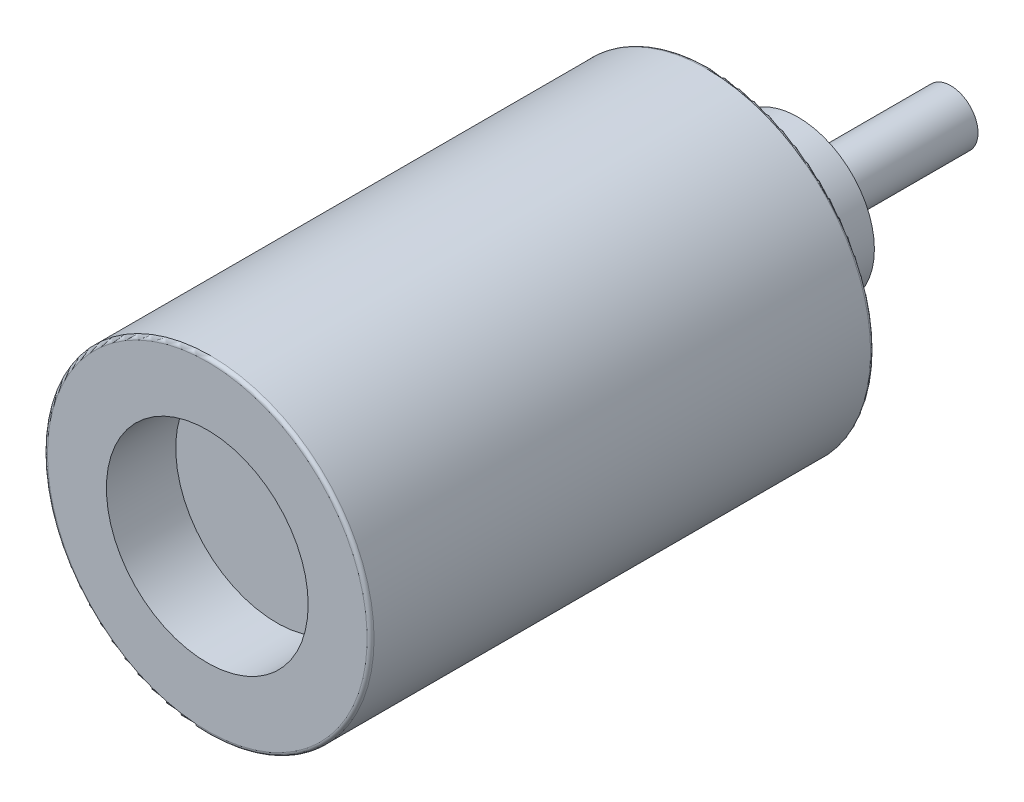
ISO-10303-21;
HEADER;
FILE_DESCRIPTION(('STEP AP214'),'2;1');
FILE_NAME('part.step','',(''),(''),'','','');
FILE_SCHEMA(('AUTOMOTIVE_DESIGN { 1 0 10303 214 1 1 1 1 }'));
ENDSEC;
DATA;
#1=APPLICATION_CONTEXT('core data for automotive mechanical design processes');
#2=APPLICATION_PROTOCOL_DEFINITION('international standard','automotive_design',2000,#1);
#3=PRODUCT_CONTEXT('',#1,'mechanical');
#4=PRODUCT('Part','Part','',(#3));
#5=PRODUCT_RELATED_PRODUCT_CATEGORY('part','',(#4));
#6=PRODUCT_DEFINITION_FORMATION('','',#4);
#7=PRODUCT_DEFINITION_CONTEXT('part definition',#1,'design');
#8=PRODUCT_DEFINITION('design','',#6,#7);
#9=PRODUCT_DEFINITION_SHAPE('','',#8);
#10=(LENGTH_UNIT() NAMED_UNIT(*) SI_UNIT(.MILLI.,.METRE.));
#11=(NAMED_UNIT(*) PLANE_ANGLE_UNIT() SI_UNIT($,.RADIAN.));
#12=(NAMED_UNIT(*) SI_UNIT($,.STERADIAN.) SOLID_ANGLE_UNIT());
#13=UNCERTAINTY_MEASURE_WITH_UNIT(LENGTH_MEASURE(1.E-05),#10,'distance_accuracy_value','');
#14=(GEOMETRIC_REPRESENTATION_CONTEXT(3) GLOBAL_UNCERTAINTY_ASSIGNED_CONTEXT((#13)) GLOBAL_UNIT_ASSIGNED_CONTEXT((#10,
#11,#12)) REPRESENTATION_CONTEXT('',''));
#15=CARTESIAN_POINT('',(0.,0.,0.));
#16=DIRECTION('',(0.,0.,1.));
#17=DIRECTION('',(1.,0.,0.));
#18=AXIS2_PLACEMENT_3D('',#15,#16,#17);
#19=CARTESIAN_POINT('',(0.,2.99085,0.));
#20=DIRECTION('',(0.,0.,-1.));
#21=DIRECTION('',(-1.,0.,0.));
#22=AXIS2_PLACEMENT_3D('',#19,#20,#21);
#23=PLANE('',#22);
#24=CARTESIAN_POINT('',(0.,0.,0.));
#25=DIRECTION('',(0.,0.,-1.));
#26=DIRECTION('',(-1.,0.,0.));
#27=AXIS2_PLACEMENT_3D('',#24,#25,#26);
#28=CIRCLE('',#27,2.92735);
#29=CARTESIAN_POINT('',(-2.92735,0.,0.));
#30=VERTEX_POINT('',#29);
#31=EDGE_CURVE('E10',#30,#30,#28,.F.);
#32=ORIENTED_EDGE('',*,*,#31,.T.);
#33=EDGE_LOOP('',(#32));
#34=FACE_BOUND('',#33,.T.);
#35=CARTESIAN_POINT('',(0.,0.,0.));
#36=DIRECTION('',(0.,0.,1.));
#37=DIRECTION('',(1.,0.,0.));
#38=AXIS2_PLACEMENT_3D('',#35,#36,#37);
#39=CIRCLE('',#38,1.84785);
#40=CARTESIAN_POINT('',(1.84785,0.,0.));
#41=VERTEX_POINT('',#40);
#42=EDGE_CURVE('E54',#41,#41,#39,.T.);
#43=ORIENTED_EDGE('',*,*,#42,.F.);
#44=EDGE_LOOP('',(#43));
#45=FACE_BOUND('',#44,.T.);
#46=ADVANCED_FACE('F34',(#34,#45),#23,.F.);
#47=CARTESIAN_POINT('',(0.,0.,14.4044306177061));
#48=DIRECTION('',(0.,0.,1.));
#49=DIRECTION('',(1.,0.,0.));
#50=AXIS2_PLACEMENT_3D('',#47,#48,#49);
#51=CYLINDRICAL_SURFACE('',#50,1.84785);
#52=CARTESIAN_POINT('',(0.,0.,-1.27));
#53=DIRECTION('',(0.,0.,1.));
#54=DIRECTION('',(1.,0.,0.));
#55=AXIS2_PLACEMENT_3D('',#52,#53,#54);
#56=CIRCLE('',#55,1.84785);
#57=CARTESIAN_POINT('',(1.84785,0.,-1.27));
#58=VERTEX_POINT('',#57);
#59=EDGE_CURVE('E57',#58,#58,#56,.T.);
#60=ORIENTED_EDGE('',*,*,#59,.F.);
#61=EDGE_LOOP('',(#60));
#62=FACE_BOUND('',#61,.T.);
#63=ORIENTED_EDGE('',*,*,#42,.T.);
#64=EDGE_LOOP('',(#63));
#65=FACE_BOUND('',#64,.T.);
#66=ADVANCED_FACE('F100',(#62,#65),#51,.F.);
#67=CARTESIAN_POINT('',(0.,1.84785,-1.27));
#68=DIRECTION('',(0.,0.,-1.));
#69=DIRECTION('',(-1.,0.,0.));
#70=AXIS2_PLACEMENT_3D('',#67,#68,#69);
#71=PLANE('',#70);
#72=ORIENTED_EDGE('',*,*,#59,.T.);
#73=EDGE_LOOP('',(#72));
#74=FACE_BOUND('',#73,.T.);
#75=ADVANCED_FACE('F95',(#74),#71,.F.);
#76=CARTESIAN_POINT('',(0.,0.5,-13.6144));
#77=DIRECTION('',(0.,0.,1.));
#78=DIRECTION('',(1.,0.,0.));
#79=AXIS2_PLACEMENT_3D('',#76,#77,#78);
#80=PLANE('',#79);
#81=CARTESIAN_POINT('',(0.,0.,-13.6144));
#82=DIRECTION('',(0.,0.,1.));
#83=DIRECTION('',(1.,0.,0.));
#84=AXIS2_PLACEMENT_3D('',#81,#82,#83);
#85=CIRCLE('',#84,0.5);
#86=CARTESIAN_POINT('',(0.5,0.,-13.6144));
#87=VERTEX_POINT('',#86);
#88=EDGE_CURVE('E60',#87,#87,#85,.T.);
#89=ORIENTED_EDGE('',*,*,#88,.F.);
#90=EDGE_LOOP('',(#89));
#91=FACE_BOUND('',#90,.T.);
#92=ADVANCED_FACE('F90',(#91),#80,.F.);
#93=CARTESIAN_POINT('',(0.,0.,14.4044306177061));
#94=DIRECTION('',(0.,0.,1.));
#95=DIRECTION('',(1.,0.,0.));
#96=AXIS2_PLACEMENT_3D('',#93,#94,#95);
#97=CYLINDRICAL_SURFACE('',#96,0.5);
#98=CARTESIAN_POINT('',(0.,0.,-10.8204));
#99=DIRECTION('',(0.,0.,1.));
#100=DIRECTION('',(1.,0.,0.));
#101=AXIS2_PLACEMENT_3D('',#98,#99,#100);
#102=CIRCLE('',#101,0.5);
#103=CARTESIAN_POINT('',(0.5,0.,-10.8204));
#104=VERTEX_POINT('',#103);
#105=EDGE_CURVE('E63',#104,#104,#102,.T.);
#106=ORIENTED_EDGE('',*,*,#105,.F.);
#107=EDGE_LOOP('',(#106));
#108=FACE_BOUND('',#107,.T.);
#109=ORIENTED_EDGE('',*,*,#88,.T.);
#110=EDGE_LOOP('',(#109));
#111=FACE_BOUND('',#110,.T.);
#112=ADVANCED_FACE('F84',(#108,#111),#97,.T.);
#113=CARTESIAN_POINT('',(0.,1.397,-10.8204));
#114=DIRECTION('',(0.,0.,1.));
#115=DIRECTION('',(1.,0.,0.));
#116=AXIS2_PLACEMENT_3D('',#113,#114,#115);
#117=PLANE('',#116);
#118=CARTESIAN_POINT('',(0.,0.,-10.8204));
#119=DIRECTION('',(0.,0.,1.));
#120=DIRECTION('',(1.,0.,0.));
#121=AXIS2_PLACEMENT_3D('',#118,#119,#120);
#122=CIRCLE('',#121,1.397);
#123=CARTESIAN_POINT('',(1.397,0.,-10.8204));
#124=VERTEX_POINT('',#123);
#125=EDGE_CURVE('E66',#124,#124,#122,.T.);
#126=ORIENTED_EDGE('',*,*,#125,.F.);
#127=EDGE_LOOP('',(#126));
#128=FACE_BOUND('',#127,.T.);
#129=ORIENTED_EDGE('',*,*,#105,.T.);
#130=EDGE_LOOP('',(#129));
#131=FACE_BOUND('',#130,.T.);
#132=ADVANCED_FACE('F78',(#128,#131),#117,.F.);
#133=CARTESIAN_POINT('',(0.,0.,14.4044306177061));
#134=DIRECTION('',(0.,0.,1.));
#135=DIRECTION('',(1.,0.,0.));
#136=AXIS2_PLACEMENT_3D('',#133,#134,#135);
#137=CYLINDRICAL_SURFACE('',#136,1.397);
#138=CARTESIAN_POINT('',(0.,0.,-9.2202));
#139=DIRECTION('',(0.,0.,1.));
#140=DIRECTION('',(1.,0.,0.));
#141=AXIS2_PLACEMENT_3D('',#138,#139,#140);
#142=CIRCLE('',#141,1.397);
#143=CARTESIAN_POINT('',(1.397,0.,-9.2202));
#144=VERTEX_POINT('',#143);
#145=EDGE_CURVE('E69',#144,#144,#142,.T.);
#146=ORIENTED_EDGE('',*,*,#145,.F.);
#147=EDGE_LOOP('',(#146));
#148=FACE_BOUND('',#147,.T.);
#149=ORIENTED_EDGE('',*,*,#125,.T.);
#150=EDGE_LOOP('',(#149));
#151=FACE_BOUND('',#150,.T.);
#152=ADVANCED_FACE('F75',(#148,#151),#137,.T.);
#153=CARTESIAN_POINT('',(0.,2.99085,-9.2202));
#154=DIRECTION('',(0.,0.,1.));
#155=DIRECTION('',(1.,0.,0.));
#156=AXIS2_PLACEMENT_3D('',#153,#154,#155);
#157=PLANE('',#156);
#158=CARTESIAN_POINT('',(0.,0.,-9.2202));
#159=DIRECTION('',(0.,0.,1.));
#160=DIRECTION('',(1.,0.,0.));
#161=AXIS2_PLACEMENT_3D('',#158,#159,#160);
#162=CIRCLE('',#161,2.92735);
#163=CARTESIAN_POINT('',(2.92735,0.,-9.2202));
#164=VERTEX_POINT('',#163);
#165=EDGE_CURVE('E41',#164,#164,#162,.F.);
#166=ORIENTED_EDGE('',*,*,#165,.T.);
#167=EDGE_LOOP('',(#166));
#168=FACE_BOUND('',#167,.T.);
#169=ORIENTED_EDGE('',*,*,#145,.T.);
#170=EDGE_LOOP('',(#169));
#171=FACE_BOUND('',#170,.T.);
#172=ADVANCED_FACE('F73',(#168,#171),#157,.F.);
#173=CARTESIAN_POINT('',(0.,0.,14.4044306177061));
#174=DIRECTION('',(0.,0.,1.));
#175=DIRECTION('',(1.,0.,0.));
#176=AXIS2_PLACEMENT_3D('',#173,#174,#175);
#177=CYLINDRICAL_SURFACE('',#176,2.99085);
#178=CARTESIAN_POINT('',(0.,0.,-9.1567));
#179=DIRECTION('',(0.,0.,1.));
#180=DIRECTION('',(1.,0.,0.));
#181=AXIS2_PLACEMENT_3D('',#178,#179,#180);
#182=CIRCLE('',#181,2.99085);
#183=CARTESIAN_POINT('',(2.99085,0.,-9.1567));
#184=VERTEX_POINT('',#183);
#185=EDGE_CURVE('E45',#184,#184,#182,.T.);
#186=ORIENTED_EDGE('',*,*,#185,.T.);
#187=EDGE_LOOP('',(#186));
#188=FACE_BOUND('',#187,.T.);
#189=CARTESIAN_POINT('',(0.,0.,-0.0634999999999993));
#190=DIRECTION('',(0.,0.,-1.));
#191=DIRECTION('',(-1.,0.,0.));
#192=AXIS2_PLACEMENT_3D('',#189,#190,#191);
#193=CIRCLE('',#192,2.99085);
#194=CARTESIAN_POINT('',(-2.99085,0.,-0.0634999999999993));
#195=VERTEX_POINT('',#194);
#196=EDGE_CURVE('E49',#195,#195,#193,.T.);
#197=ORIENTED_EDGE('',*,*,#196,.T.);
#198=EDGE_LOOP('',(#197));
#199=FACE_BOUND('',#198,.T.);
#200=ADVANCED_FACE('F113',(#188,#199),#177,.T.);
#201=CARTESIAN_POINT('',(0.,0.,-9.1567));
#202=DIRECTION('',(0.,0.,1.));
#203=DIRECTION('',(1.,0.,0.));
#204=AXIS2_PLACEMENT_3D('',#201,#202,#203);
#205=TOROIDAL_SURFACE('',#204,2.92735,0.0635);
#206=ORIENTED_EDGE('',*,*,#165,.F.);
#207=EDGE_LOOP('',(#206));
#208=FACE_BOUND('',#207,.T.);
#209=ORIENTED_EDGE('',*,*,#185,.F.);
#210=EDGE_LOOP('',(#209));
#211=FACE_BOUND('',#210,.T.);
#212=ADVANCED_FACE('F111',(#208,#211),#205,.T.);
#213=CARTESIAN_POINT('',(0.,0.,-0.0634999999999993));
#214=DIRECTION('',(0.,0.,-1.));
#215=DIRECTION('',(-1.,0.,0.));
#216=AXIS2_PLACEMENT_3D('',#213,#214,#215);
#217=TOROIDAL_SURFACE('',#216,2.92735,0.0635);
#218=ORIENTED_EDGE('',*,*,#196,.F.);
#219=EDGE_LOOP('',(#218));
#220=FACE_BOUND('',#219,.T.);
#221=ORIENTED_EDGE('',*,*,#31,.F.);
#222=EDGE_LOOP('',(#221));
#223=FACE_BOUND('',#222,.T.);
#224=ADVANCED_FACE('F36',(#220,#223),#217,.T.);
#225=CLOSED_SHELL('',(#46,#66,#75,#92,#112,#132,#152,#172,#200,#212,#224));
#226=MANIFOLD_SOLID_BREP('B2',#225);
#227=ADVANCED_BREP_SHAPE_REPRESENTATION('',(#18,#226),#14);
#228=SHAPE_DEFINITION_REPRESENTATION(#9,#227);
ENDSEC;
END-ISO-10303-21;
